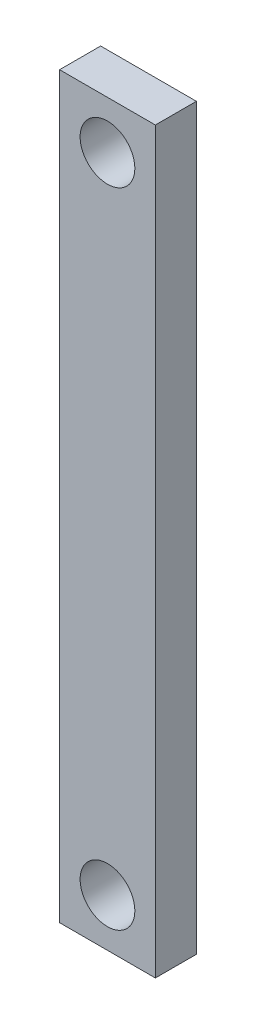
ISO-10303-21;
HEADER;
FILE_DESCRIPTION(('STEP AP214'),'2;1');
FILE_NAME('part.step','',(''),(''),'','','');
FILE_SCHEMA(('AUTOMOTIVE_DESIGN { 1 0 10303 214 1 1 1 1 }'));
ENDSEC;
DATA;
#1=APPLICATION_CONTEXT('core data for automotive mechanical design processes');
#2=APPLICATION_PROTOCOL_DEFINITION('international standard','automotive_design',2000,#1);
#3=PRODUCT_CONTEXT('',#1,'mechanical');
#4=PRODUCT('Part','Part','',(#3));
#5=PRODUCT_RELATED_PRODUCT_CATEGORY('part','',(#4));
#6=PRODUCT_DEFINITION_FORMATION('','',#4);
#7=PRODUCT_DEFINITION_CONTEXT('part definition',#1,'design');
#8=PRODUCT_DEFINITION('design','',#6,#7);
#9=PRODUCT_DEFINITION_SHAPE('','',#8);
#10=(LENGTH_UNIT() NAMED_UNIT(*) SI_UNIT(.MILLI.,.METRE.));
#11=(NAMED_UNIT(*) PLANE_ANGLE_UNIT() SI_UNIT($,.RADIAN.));
#12=(NAMED_UNIT(*) SI_UNIT($,.STERADIAN.) SOLID_ANGLE_UNIT());
#13=UNCERTAINTY_MEASURE_WITH_UNIT(LENGTH_MEASURE(1.E-05),#10,'distance_accuracy_value','');
#14=(GEOMETRIC_REPRESENTATION_CONTEXT(3) GLOBAL_UNCERTAINTY_ASSIGNED_CONTEXT((#13)) GLOBAL_UNIT_ASSIGNED_CONTEXT((#10,
#11,#12)) REPRESENTATION_CONTEXT('',''));
#15=CARTESIAN_POINT('',(0.,0.,0.));
#16=DIRECTION('',(0.,0.,1.));
#17=DIRECTION('',(1.,0.,0.));
#18=AXIS2_PLACEMENT_3D('',#15,#16,#17);
#19=CARTESIAN_POINT('',(0.,-270.,15.));
#20=DIRECTION('',(-1.,0.,0.));
#21=DIRECTION('',(0.,0.,1.));
#22=AXIS2_PLACEMENT_3D('',#19,#20,#21);
#23=PLANE('',#22);
#24=DIRECTION('',(0.,1.,0.));
#25=VECTOR('',#24,1.);
#26=CARTESIAN_POINT('',(0.,-270.,0.));
#27=LINE('',#26,#25);
#28=CARTESIAN_POINT('',(0.,-270.,0.));
#29=VERTEX_POINT('',#28);
#30=CARTESIAN_POINT('',(0.,0.,0.));
#31=VERTEX_POINT('',#30);
#32=EDGE_CURVE('E97',#29,#31,#27,.T.);
#33=ORIENTED_EDGE('',*,*,#32,.T.);
#34=DIRECTION('',(0.,0.,-1.));
#35=VECTOR('',#34,1.);
#36=CARTESIAN_POINT('',(0.,0.,15.));
#37=LINE('',#36,#35);
#38=CARTESIAN_POINT('',(0.,0.,15.));
#39=VERTEX_POINT('',#38);
#40=EDGE_CURVE('E11',#39,#31,#37,.T.);
#41=ORIENTED_EDGE('',*,*,#40,.F.);
#42=DIRECTION('',(0.,1.,0.));
#43=VECTOR('',#42,1.);
#44=CARTESIAN_POINT('',(0.,-270.,15.));
#45=LINE('',#44,#43);
#46=CARTESIAN_POINT('',(0.,-270.,15.));
#47=VERTEX_POINT('',#46);
#48=EDGE_CURVE('E85',#47,#39,#45,.T.);
#49=ORIENTED_EDGE('',*,*,#48,.F.);
#50=DIRECTION('',(0.,0.,-1.));
#51=VECTOR('',#50,1.);
#52=CARTESIAN_POINT('',(0.,-270.,15.));
#53=LINE('',#52,#51);
#54=EDGE_CURVE('E93',#47,#29,#53,.T.);
#55=ORIENTED_EDGE('',*,*,#54,.T.);
#56=EDGE_LOOP('',(#33,#41,#49,#55));
#57=FACE_BOUND('',#56,.T.);
#58=ADVANCED_FACE('F34',(#57),#23,.F.);
#59=CARTESIAN_POINT('',(0.,0.,15.));
#60=DIRECTION('',(0.,-1.,0.));
#61=DIRECTION('',(0.,0.,-1.));
#62=AXIS2_PLACEMENT_3D('',#59,#60,#61);
#63=PLANE('',#62);
#64=DIRECTION('',(-1.,0.,0.));
#65=VECTOR('',#64,1.);
#66=CARTESIAN_POINT('',(0.,0.,0.));
#67=LINE('',#66,#65);
#68=CARTESIAN_POINT('',(-35.,0.,0.));
#69=VERTEX_POINT('',#68);
#70=EDGE_CURVE('E89',#31,#69,#67,.T.);
#71=ORIENTED_EDGE('',*,*,#70,.T.);
#72=DIRECTION('',(0.,0.,-1.));
#73=VECTOR('',#72,1.);
#74=CARTESIAN_POINT('',(-35.,0.,15.));
#75=LINE('',#74,#73);
#76=CARTESIAN_POINT('',(-35.,0.,15.));
#77=VERTEX_POINT('',#76);
#78=EDGE_CURVE('E42',#77,#69,#75,.T.);
#79=ORIENTED_EDGE('',*,*,#78,.F.);
#80=DIRECTION('',(-1.,0.,0.));
#81=VECTOR('',#80,1.);
#82=CARTESIAN_POINT('',(0.,0.,15.));
#83=LINE('',#82,#81);
#84=EDGE_CURVE('E80',#39,#77,#83,.T.);
#85=ORIENTED_EDGE('',*,*,#84,.F.);
#86=ORIENTED_EDGE('',*,*,#40,.T.);
#87=EDGE_LOOP('',(#71,#79,#85,#86));
#88=FACE_BOUND('',#87,.T.);
#89=ADVANCED_FACE('F88',(#88),#63,.F.);
#90=CARTESIAN_POINT('',(-35.,0.,15.));
#91=DIRECTION('',(1.,0.,0.));
#92=DIRECTION('',(0.,1.,0.));
#93=AXIS2_PLACEMENT_3D('',#90,#91,#92);
#94=PLANE('',#93);
#95=DIRECTION('',(0.,-1.,0.));
#96=VECTOR('',#95,1.);
#97=CARTESIAN_POINT('',(-35.,0.,0.));
#98=LINE('',#97,#96);
#99=CARTESIAN_POINT('',(-35.,-270.,0.));
#100=VERTEX_POINT('',#99);
#101=EDGE_CURVE('E67',#69,#100,#98,.T.);
#102=ORIENTED_EDGE('',*,*,#101,.T.);
#103=DIRECTION('',(0.,0.,-1.));
#104=VECTOR('',#103,1.);
#105=CARTESIAN_POINT('',(-35.,-270.,15.));
#106=LINE('',#105,#104);
#107=CARTESIAN_POINT('',(-35.,-270.,15.));
#108=VERTEX_POINT('',#107);
#109=EDGE_CURVE('E90',#108,#100,#106,.T.);
#110=ORIENTED_EDGE('',*,*,#109,.F.);
#111=DIRECTION('',(0.,-1.,0.));
#112=VECTOR('',#111,1.);
#113=CARTESIAN_POINT('',(-35.,0.,15.));
#114=LINE('',#113,#112);
#115=EDGE_CURVE('E83',#77,#108,#114,.T.);
#116=ORIENTED_EDGE('',*,*,#115,.F.);
#117=ORIENTED_EDGE('',*,*,#78,.T.);
#118=EDGE_LOOP('',(#102,#110,#116,#117));
#119=FACE_BOUND('',#118,.T.);
#120=ADVANCED_FACE('F91',(#119),#94,.F.);
#121=CARTESIAN_POINT('',(-35.,-270.,15.));
#122=DIRECTION('',(0.,1.,0.));
#123=DIRECTION('',(0.,0.,1.));
#124=AXIS2_PLACEMENT_3D('',#121,#122,#123);
#125=PLANE('',#124);
#126=DIRECTION('',(1.,0.,0.));
#127=VECTOR('',#126,1.);
#128=CARTESIAN_POINT('',(-35.,-270.,0.));
#129=LINE('',#128,#127);
#130=EDGE_CURVE('E73',#100,#29,#129,.T.);
#131=ORIENTED_EDGE('',*,*,#130,.T.);
#132=ORIENTED_EDGE('',*,*,#54,.F.);
#133=DIRECTION('',(1.,0.,0.));
#134=VECTOR('',#133,1.);
#135=CARTESIAN_POINT('',(-35.,-270.,15.));
#136=LINE('',#135,#134);
#137=EDGE_CURVE('E50',#108,#47,#136,.T.);
#138=ORIENTED_EDGE('',*,*,#137,.F.);
#139=ORIENTED_EDGE('',*,*,#109,.T.);
#140=EDGE_LOOP('',(#131,#132,#138,#139));
#141=FACE_BOUND('',#140,.T.);
#142=ADVANCED_FACE('F105',(#141),#125,.F.);
#143=CARTESIAN_POINT('',(0.,0.,15.));
#144=DIRECTION('',(0.,0.,1.));
#145=DIRECTION('',(1.,0.,0.));
#146=AXIS2_PLACEMENT_3D('',#143,#144,#145);
#147=PLANE('',#146);
#148=CARTESIAN_POINT('',(-17.5,-17.5,15.));
#149=DIRECTION('',(0.,0.,1.));
#150=DIRECTION('',(1.,0.,0.));
#151=AXIS2_PLACEMENT_3D('',#148,#149,#150);
#152=CIRCLE('',#151,9.99999999999999);
#153=CARTESIAN_POINT('',(-7.50000000000001,-17.5,15.));
#154=VERTEX_POINT('',#153);
#155=EDGE_CURVE('E119',#154,#154,#152,.T.);
#156=ORIENTED_EDGE('',*,*,#155,.F.);
#157=EDGE_LOOP('',(#156));
#158=FACE_BOUND('',#157,.T.);
#159=CARTESIAN_POINT('',(-17.5,-252.5,15.));
#160=DIRECTION('',(0.,0.,1.));
#161=DIRECTION('',(1.,0.,0.));
#162=AXIS2_PLACEMENT_3D('',#159,#160,#161);
#163=CIRCLE('',#162,9.99999999999999);
#164=CARTESIAN_POINT('',(-7.5,-252.5,15.));
#165=VERTEX_POINT('',#164);
#166=EDGE_CURVE('E113',#165,#165,#163,.T.);
#167=ORIENTED_EDGE('',*,*,#166,.F.);
#168=EDGE_LOOP('',(#167));
#169=FACE_BOUND('',#168,.T.);
#170=ORIENTED_EDGE('',*,*,#48,.T.);
#171=ORIENTED_EDGE('',*,*,#84,.T.);
#172=ORIENTED_EDGE('',*,*,#115,.T.);
#173=ORIENTED_EDGE('',*,*,#137,.T.);
#174=EDGE_LOOP('',(#170,#171,#172,#173));
#175=FACE_BOUND('',#174,.T.);
#176=ADVANCED_FACE('F81',(#158,#169,#175),#147,.T.);
#177=CARTESIAN_POINT('',(0.,0.,0.));
#178=DIRECTION('',(0.,0.,1.));
#179=DIRECTION('',(1.,0.,0.));
#180=AXIS2_PLACEMENT_3D('',#177,#178,#179);
#181=PLANE('',#180);
#182=CARTESIAN_POINT('',(-17.5,-17.5,0.));
#183=DIRECTION('',(0.,0.,1.));
#184=DIRECTION('',(1.,0.,0.));
#185=AXIS2_PLACEMENT_3D('',#182,#183,#184);
#186=CIRCLE('',#185,10.);
#187=CARTESIAN_POINT('',(-7.50000000000001,-17.5,0.));
#188=VERTEX_POINT('',#187);
#189=EDGE_CURVE('E116',#188,#188,#186,.T.);
#190=ORIENTED_EDGE('',*,*,#189,.T.);
#191=EDGE_LOOP('',(#190));
#192=FACE_BOUND('',#191,.T.);
#193=CARTESIAN_POINT('',(-17.5,-252.5,0.));
#194=DIRECTION('',(0.,0.,1.));
#195=DIRECTION('',(1.,0.,0.));
#196=AXIS2_PLACEMENT_3D('',#193,#194,#195);
#197=CIRCLE('',#196,10.);
#198=CARTESIAN_POINT('',(-7.49999999999999,-252.5,0.));
#199=VERTEX_POINT('',#198);
#200=EDGE_CURVE('E100',#199,#199,#197,.T.);
#201=ORIENTED_EDGE('',*,*,#200,.T.);
#202=EDGE_LOOP('',(#201));
#203=FACE_BOUND('',#202,.T.);
#204=ORIENTED_EDGE('',*,*,#32,.F.);
#205=ORIENTED_EDGE('',*,*,#130,.F.);
#206=ORIENTED_EDGE('',*,*,#101,.F.);
#207=ORIENTED_EDGE('',*,*,#70,.F.);
#208=EDGE_LOOP('',(#204,#205,#206,#207));
#209=FACE_BOUND('',#208,.T.);
#210=ADVANCED_FACE('F108',(#192,#203,#209),#181,.F.);
#211=CARTESIAN_POINT('',(-17.5,-252.5,15.));
#212=DIRECTION('',(0.,0.,1.));
#213=DIRECTION('',(1.,0.,0.));
#214=AXIS2_PLACEMENT_3D('',#211,#212,#213);
#215=CYLINDRICAL_SURFACE('',#214,9.99999999999999);
#216=ORIENTED_EDGE('',*,*,#200,.F.);
#217=EDGE_LOOP('',(#216));
#218=FACE_BOUND('',#217,.T.);
#219=ORIENTED_EDGE('',*,*,#166,.T.);
#220=EDGE_LOOP('',(#219));
#221=FACE_BOUND('',#220,.T.);
#222=ADVANCED_FACE('F130',(#218,#221),#215,.F.);
#223=CARTESIAN_POINT('',(-17.5,-17.5,15.));
#224=DIRECTION('',(0.,0.,1.));
#225=DIRECTION('',(1.,0.,0.));
#226=AXIS2_PLACEMENT_3D('',#223,#224,#225);
#227=CYLINDRICAL_SURFACE('',#226,9.99999999999999);
#228=ORIENTED_EDGE('',*,*,#189,.F.);
#229=EDGE_LOOP('',(#228));
#230=FACE_BOUND('',#229,.T.);
#231=ORIENTED_EDGE('',*,*,#155,.T.);
#232=EDGE_LOOP('',(#231));
#233=FACE_BOUND('',#232,.T.);
#234=ADVANCED_FACE('F123',(#230,#233),#227,.F.);
#235=CLOSED_SHELL('',(#58,#89,#120,#142,#176,#210,#222,#234));
#236=MANIFOLD_SOLID_BREP('B2',#235);
#237=ADVANCED_BREP_SHAPE_REPRESENTATION('',(#18,#236),#14);
#238=SHAPE_DEFINITION_REPRESENTATION(#9,#237);
ENDSEC;
END-ISO-10303-21;
